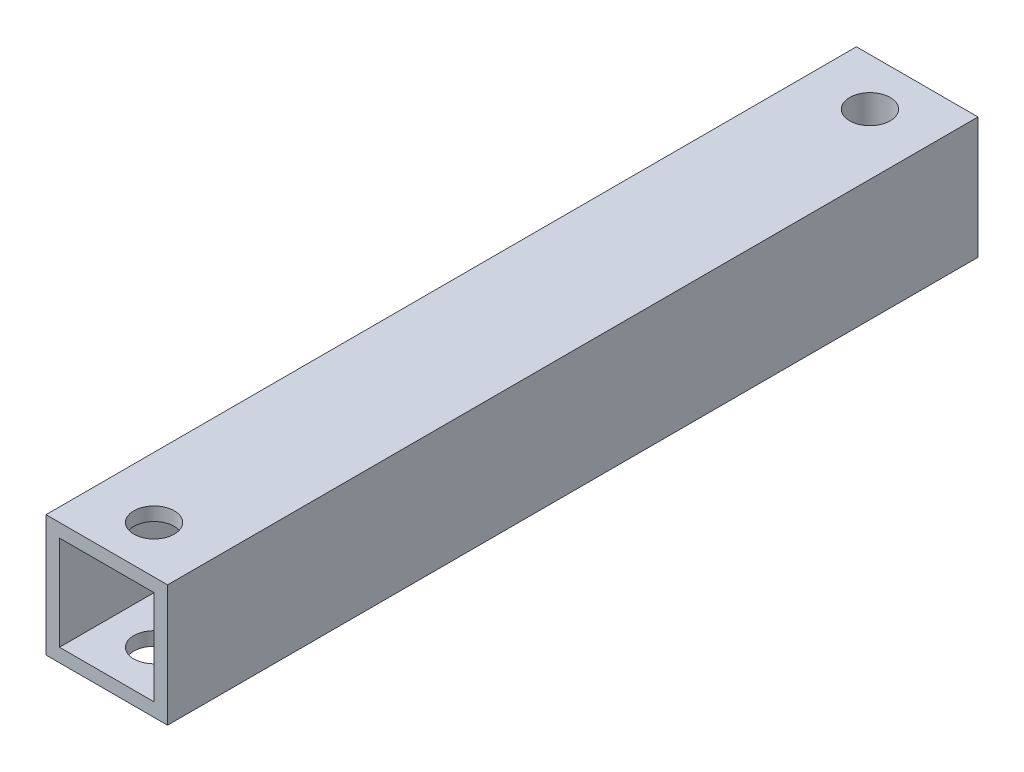
ISO-10303-21;
HEADER;
FILE_DESCRIPTION(('STEP AP214'),'2;1');
FILE_NAME('part.step','',(''),(''),'','','');
FILE_SCHEMA(('AUTOMOTIVE_DESIGN { 1 0 10303 214 1 1 1 1 }'));
ENDSEC;
DATA;
#1=APPLICATION_CONTEXT('core data for automotive mechanical design processes');
#2=APPLICATION_PROTOCOL_DEFINITION('international standard','automotive_design',2000,#1);
#3=PRODUCT_CONTEXT('',#1,'mechanical');
#4=PRODUCT('Part','Part','',(#3));
#5=PRODUCT_RELATED_PRODUCT_CATEGORY('part','',(#4));
#6=PRODUCT_DEFINITION_FORMATION('','',#4);
#7=PRODUCT_DEFINITION_CONTEXT('part definition',#1,'design');
#8=PRODUCT_DEFINITION('design','',#6,#7);
#9=PRODUCT_DEFINITION_SHAPE('','',#8);
#10=(LENGTH_UNIT() NAMED_UNIT(*) SI_UNIT(.MILLI.,.METRE.));
#11=(NAMED_UNIT(*) PLANE_ANGLE_UNIT() SI_UNIT($,.RADIAN.));
#12=(NAMED_UNIT(*) SI_UNIT($,.STERADIAN.) SOLID_ANGLE_UNIT());
#13=UNCERTAINTY_MEASURE_WITH_UNIT(LENGTH_MEASURE(1.E-05),#10,'distance_accuracy_value','');
#14=(GEOMETRIC_REPRESENTATION_CONTEXT(3) GLOBAL_UNCERTAINTY_ASSIGNED_CONTEXT((#13)) GLOBAL_UNIT_ASSIGNED_CONTEXT((#10,
#11,#12)) REPRESENTATION_CONTEXT('',''));
#15=CARTESIAN_POINT('',(0.,0.,0.));
#16=DIRECTION('',(0.,0.,1.));
#17=DIRECTION('',(1.,0.,0.));
#18=AXIS2_PLACEMENT_3D('',#15,#16,#17);
#19=CARTESIAN_POINT('',(0.,0.,4.));
#20=DIRECTION('',(0.,0.,1.));
#21=DIRECTION('',(1.,0.,0.));
#22=AXIS2_PLACEMENT_3D('',#19,#20,#21);
#23=PLANE('',#22);
#24=DIRECTION('',(0.,1.,0.));
#25=VECTOR('',#24,1.);
#26=CARTESIAN_POINT('',(1.4142135623731,-51.5,4.));
#27=LINE('',#26,#25);
#28=CARTESIAN_POINT('',(1.4142135623731,-3.5,4.));
#29=VERTEX_POINT('',#28);
#30=CARTESIAN_POINT('',(1.4142135623731,3.5,4.));
#31=VERTEX_POINT('',#30);
#32=EDGE_CURVE('E11',#29,#31,#27,.T.);
#33=ORIENTED_EDGE('',*,*,#32,.F.);
#34=DIRECTION('',(1.,0.,0.));
#35=VECTOR('',#34,1.);
#36=CARTESIAN_POINT('',(-3.5,-3.5,4.));
#37=LINE('',#36,#35);
#38=CARTESIAN_POINT('',(3.5,-3.5,4.));
#39=VERTEX_POINT('',#38);
#40=EDGE_CURVE('E123',#29,#39,#37,.T.);
#41=ORIENTED_EDGE('',*,*,#40,.T.);
#42=DIRECTION('',(0.,1.,0.));
#43=VECTOR('',#42,1.);
#44=CARTESIAN_POINT('',(3.5,3.5,4.));
#45=LINE('',#44,#43);
#46=CARTESIAN_POINT('',(3.5,3.5,4.));
#47=VERTEX_POINT('',#46);
#48=EDGE_CURVE('E148',#39,#47,#45,.T.);
#49=ORIENTED_EDGE('',*,*,#48,.T.);
#50=DIRECTION('',(-1.,0.,0.));
#51=VECTOR('',#50,1.);
#52=CARTESIAN_POINT('',(-3.5,3.5,4.));
#53=LINE('',#52,#51);
#54=EDGE_CURVE('E260',#47,#31,#53,.T.);
#55=ORIENTED_EDGE('',*,*,#54,.T.);
#56=EDGE_LOOP('',(#33,#41,#49,#55));
#57=FACE_BOUND('',#56,.T.);
#58=ADVANCED_FACE('F33',(#57),#23,.T.);
#59=CARTESIAN_POINT('',(4.5,4.5,60.));
#60=DIRECTION('',(-1.,0.,0.));
#61=DIRECTION('',(0.,0.,1.));
#62=AXIS2_PLACEMENT_3D('',#59,#60,#61);
#63=PLANE('',#62);
#64=DIRECTION('',(0.,1.,0.));
#65=VECTOR('',#64,1.);
#66=CARTESIAN_POINT('',(4.5,4.5,0.));
#67=LINE('',#66,#65);
#68=CARTESIAN_POINT('',(4.5,-4.5,0.));
#69=VERTEX_POINT('',#68);
#70=CARTESIAN_POINT('',(4.5,4.5,0.));
#71=VERTEX_POINT('',#70);
#72=EDGE_CURVE('E151',#69,#71,#67,.T.);
#73=ORIENTED_EDGE('',*,*,#72,.T.);
#74=DIRECTION('',(0.,0.,-1.));
#75=VECTOR('',#74,1.);
#76=CARTESIAN_POINT('',(4.5,4.5,60.));
#77=LINE('',#76,#75);
#78=CARTESIAN_POINT('',(4.5,4.5,60.));
#79=VERTEX_POINT('',#78);
#80=EDGE_CURVE('E115',#79,#71,#77,.T.);
#81=ORIENTED_EDGE('',*,*,#80,.F.);
#82=DIRECTION('',(0.,1.,0.));
#83=VECTOR('',#82,1.);
#84=CARTESIAN_POINT('',(4.5,4.5,60.));
#85=LINE('',#84,#83);
#86=CARTESIAN_POINT('',(4.5,-4.5,60.));
#87=VERTEX_POINT('',#86);
#88=EDGE_CURVE('E155',#87,#79,#85,.T.);
#89=ORIENTED_EDGE('',*,*,#88,.F.);
#90=DIRECTION('',(0.,0.,-1.));
#91=VECTOR('',#90,1.);
#92=CARTESIAN_POINT('',(4.5,-4.5,60.));
#93=LINE('',#92,#91);
#94=EDGE_CURVE('E165',#87,#69,#93,.T.);
#95=ORIENTED_EDGE('',*,*,#94,.T.);
#96=EDGE_LOOP('',(#73,#81,#89,#95));
#97=FACE_BOUND('',#96,.T.);
#98=ADVANCED_FACE('F35',(#97),#63,.F.);
#99=CARTESIAN_POINT('',(-4.5,4.5,60.));
#100=DIRECTION('',(0.,-1.,0.));
#101=DIRECTION('',(0.,0.,-1.));
#102=AXIS2_PLACEMENT_3D('',#99,#100,#101);
#103=PLANE('',#102);
#104=CARTESIAN_POINT('',(0.,4.5,3.5));
#105=DIRECTION('',(0.,1.,0.));
#106=DIRECTION('',(0.,0.,1.));
#107=AXIS2_PLACEMENT_3D('',#104,#105,#106);
#108=CIRCLE('',#107,1.5);
#109=CARTESIAN_POINT('',(0.,4.5,5.));
#110=VERTEX_POINT('',#109);
#111=EDGE_CURVE('E268',#110,#110,#108,.T.);
#112=ORIENTED_EDGE('',*,*,#111,.F.);
#113=EDGE_LOOP('',(#112));
#114=FACE_BOUND('',#113,.T.);
#115=CARTESIAN_POINT('',(0.,4.5,56.5));
#116=DIRECTION('',(0.,1.,0.));
#117=DIRECTION('',(0.,0.,1.));
#118=AXIS2_PLACEMENT_3D('',#115,#116,#117);
#119=CIRCLE('',#118,1.5);
#120=CARTESIAN_POINT('',(0.,4.5,58.));
#121=VERTEX_POINT('',#120);
#122=EDGE_CURVE('E271',#121,#121,#119,.T.);
#123=ORIENTED_EDGE('',*,*,#122,.F.);
#124=EDGE_LOOP('',(#123));
#125=FACE_BOUND('',#124,.T.);
#126=DIRECTION('',(-1.,0.,0.));
#127=VECTOR('',#126,1.);
#128=CARTESIAN_POINT('',(-4.5,4.5,0.));
#129=LINE('',#128,#127);
#130=CARTESIAN_POINT('',(-4.5,4.5,0.));
#131=VERTEX_POINT('',#130);
#132=EDGE_CURVE('E168',#71,#131,#129,.T.);
#133=ORIENTED_EDGE('',*,*,#132,.T.);
#134=DIRECTION('',(0.,0.,-1.));
#135=VECTOR('',#134,1.);
#136=CARTESIAN_POINT('',(-4.5,4.5,60.));
#137=LINE('',#136,#135);
#138=CARTESIAN_POINT('',(-4.5,4.5,60.));
#139=VERTEX_POINT('',#138);
#140=EDGE_CURVE('E178',#139,#131,#137,.T.);
#141=ORIENTED_EDGE('',*,*,#140,.F.);
#142=DIRECTION('',(-1.,0.,0.));
#143=VECTOR('',#142,1.);
#144=CARTESIAN_POINT('',(-4.5,4.5,60.));
#145=LINE('',#144,#143);
#146=EDGE_CURVE('E158',#79,#139,#145,.T.);
#147=ORIENTED_EDGE('',*,*,#146,.F.);
#148=ORIENTED_EDGE('',*,*,#80,.T.);
#149=EDGE_LOOP('',(#133,#141,#147,#148));
#150=FACE_BOUND('',#149,.T.);
#151=ADVANCED_FACE('F184',(#114,#125,#150),#103,.F.);
#152=CARTESIAN_POINT('',(-4.5,4.5,60.));
#153=DIRECTION('',(1.,0.,0.));
#154=DIRECTION('',(0.,1.,0.));
#155=AXIS2_PLACEMENT_3D('',#152,#153,#154);
#156=PLANE('',#155);
#157=DIRECTION('',(0.,-1.,0.));
#158=VECTOR('',#157,1.);
#159=CARTESIAN_POINT('',(-4.5,4.5,0.));
#160=LINE('',#159,#158);
#161=CARTESIAN_POINT('',(-4.5,-4.5,0.));
#162=VERTEX_POINT('',#161);
#163=EDGE_CURVE('E170',#131,#162,#160,.T.);
#164=ORIENTED_EDGE('',*,*,#163,.T.);
#165=DIRECTION('',(0.,0.,-1.));
#166=VECTOR('',#165,1.);
#167=CARTESIAN_POINT('',(-4.5,-4.5,60.));
#168=LINE('',#167,#166);
#169=CARTESIAN_POINT('',(-4.5,-4.5,60.));
#170=VERTEX_POINT('',#169);
#171=EDGE_CURVE('E175',#170,#162,#168,.T.);
#172=ORIENTED_EDGE('',*,*,#171,.F.);
#173=DIRECTION('',(0.,-1.,0.));
#174=VECTOR('',#173,1.);
#175=CARTESIAN_POINT('',(-4.5,4.5,60.));
#176=LINE('',#175,#174);
#177=EDGE_CURVE('E161',#139,#170,#176,.T.);
#178=ORIENTED_EDGE('',*,*,#177,.F.);
#179=ORIENTED_EDGE('',*,*,#140,.T.);
#180=EDGE_LOOP('',(#164,#172,#178,#179));
#181=FACE_BOUND('',#180,.T.);
#182=ADVANCED_FACE('F196',(#181),#156,.F.);
#183=CARTESIAN_POINT('',(-4.5,-4.5,60.));
#184=DIRECTION('',(0.,1.,0.));
#185=DIRECTION('',(0.,0.,1.));
#186=AXIS2_PLACEMENT_3D('',#183,#184,#185);
#187=PLANE('',#186);
#188=CARTESIAN_POINT('',(0.,-4.5,3.5));
#189=DIRECTION('',(0.,1.,0.));
#190=DIRECTION('',(0.,0.,1.));
#191=AXIS2_PLACEMENT_3D('',#188,#189,#190);
#192=CIRCLE('',#191,1.5);
#193=CARTESIAN_POINT('',(0.,-4.5,5.));
#194=VERTEX_POINT('',#193);
#195=EDGE_CURVE('E124',#194,#194,#192,.T.);
#196=ORIENTED_EDGE('',*,*,#195,.T.);
#197=EDGE_LOOP('',(#196));
#198=FACE_BOUND('',#197,.T.);
#199=CARTESIAN_POINT('',(0.,-4.5,56.5));
#200=DIRECTION('',(0.,1.,0.));
#201=DIRECTION('',(0.,0.,1.));
#202=AXIS2_PLACEMENT_3D('',#199,#200,#201);
#203=CIRCLE('',#202,1.5);
#204=CARTESIAN_POINT('',(0.,-4.5,58.));
#205=VERTEX_POINT('',#204);
#206=EDGE_CURVE('E139',#205,#205,#203,.T.);
#207=ORIENTED_EDGE('',*,*,#206,.T.);
#208=EDGE_LOOP('',(#207));
#209=FACE_BOUND('',#208,.T.);
#210=DIRECTION('',(1.,0.,0.));
#211=VECTOR('',#210,1.);
#212=CARTESIAN_POINT('',(-4.5,-4.5,0.));
#213=LINE('',#212,#211);
#214=EDGE_CURVE('E159',#162,#69,#213,.T.);
#215=ORIENTED_EDGE('',*,*,#214,.T.);
#216=ORIENTED_EDGE('',*,*,#94,.F.);
#217=DIRECTION('',(1.,0.,0.));
#218=VECTOR('',#217,1.);
#219=CARTESIAN_POINT('',(-4.5,-4.5,60.));
#220=LINE('',#219,#218);
#221=EDGE_CURVE('E163',#170,#87,#220,.T.);
#222=ORIENTED_EDGE('',*,*,#221,.F.);
#223=ORIENTED_EDGE('',*,*,#171,.T.);
#224=EDGE_LOOP('',(#215,#216,#222,#223));
#225=FACE_BOUND('',#224,.T.);
#226=ADVANCED_FACE('F200',(#198,#209,#225),#187,.F.);
#227=CARTESIAN_POINT('',(0.,0.,60.));
#228=DIRECTION('',(0.,0.,1.));
#229=DIRECTION('',(1.,0.,0.));
#230=AXIS2_PLACEMENT_3D('',#227,#228,#229);
#231=PLANE('',#230);
#232=DIRECTION('',(0.,1.,0.));
#233=VECTOR('',#232,1.);
#234=CARTESIAN_POINT('',(3.5,3.5,60.));
#235=LINE('',#234,#233);
#236=CARTESIAN_POINT('',(3.5,-3.5,60.));
#237=VERTEX_POINT('',#236);
#238=CARTESIAN_POINT('',(3.5,3.5,60.));
#239=VERTEX_POINT('',#238);
#240=EDGE_CURVE('E56',#237,#239,#235,.T.);
#241=ORIENTED_EDGE('',*,*,#240,.F.);
#242=DIRECTION('',(1.,0.,0.));
#243=VECTOR('',#242,1.);
#244=CARTESIAN_POINT('',(-3.5,-3.5,60.));
#245=LINE('',#244,#243);
#246=CARTESIAN_POINT('',(-3.5,-3.5,60.));
#247=VERTEX_POINT('',#246);
#248=EDGE_CURVE('E145',#247,#237,#245,.T.);
#249=ORIENTED_EDGE('',*,*,#248,.F.);
#250=DIRECTION('',(0.,-1.,0.));
#251=VECTOR('',#250,1.);
#252=CARTESIAN_POINT('',(-3.5,3.5,60.));
#253=LINE('',#252,#251);
#254=CARTESIAN_POINT('',(-3.5,3.5,60.));
#255=VERTEX_POINT('',#254);
#256=EDGE_CURVE('E142',#255,#247,#253,.T.);
#257=ORIENTED_EDGE('',*,*,#256,.F.);
#258=DIRECTION('',(-1.,0.,0.));
#259=VECTOR('',#258,1.);
#260=CARTESIAN_POINT('',(-3.5,3.5,60.));
#261=LINE('',#260,#259);
#262=EDGE_CURVE('E138',#239,#255,#261,.T.);
#263=ORIENTED_EDGE('',*,*,#262,.F.);
#264=EDGE_LOOP('',(#241,#249,#257,#263));
#265=FACE_BOUND('',#264,.T.);
#266=ORIENTED_EDGE('',*,*,#88,.T.);
#267=ORIENTED_EDGE('',*,*,#146,.T.);
#268=ORIENTED_EDGE('',*,*,#177,.T.);
#269=ORIENTED_EDGE('',*,*,#221,.T.);
#270=EDGE_LOOP('',(#266,#267,#268,#269));
#271=FACE_BOUND('',#270,.T.);
#272=ADVANCED_FACE('F202',(#265,#271),#231,.T.);
#273=CARTESIAN_POINT('',(0.,0.,0.));
#274=DIRECTION('',(0.,0.,1.));
#275=DIRECTION('',(1.,0.,0.));
#276=AXIS2_PLACEMENT_3D('',#273,#274,#275);
#277=PLANE('',#276);
#278=ORIENTED_EDGE('',*,*,#72,.F.);
#279=ORIENTED_EDGE('',*,*,#214,.F.);
#280=ORIENTED_EDGE('',*,*,#163,.F.);
#281=ORIENTED_EDGE('',*,*,#132,.F.);
#282=EDGE_LOOP('',(#278,#279,#280,#281));
#283=FACE_BOUND('',#282,.T.);
#284=ADVANCED_FACE('F192',(#283),#277,.F.);
#285=CARTESIAN_POINT('',(3.5,3.5,4.));
#286=DIRECTION('',(1.,0.,0.));
#287=DIRECTION('',(0.,1.,0.));
#288=AXIS2_PLACEMENT_3D('',#285,#286,#287);
#289=PLANE('',#288);
#290=ORIENTED_EDGE('',*,*,#240,.T.);
#291=DIRECTION('',(0.,0.,1.));
#292=VECTOR('',#291,1.);
#293=CARTESIAN_POINT('',(3.5,3.5,4.));
#294=LINE('',#293,#292);
#295=EDGE_CURVE('E130',#47,#239,#294,.T.);
#296=ORIENTED_EDGE('',*,*,#295,.F.);
#297=ORIENTED_EDGE('',*,*,#48,.F.);
#298=DIRECTION('',(0.,0.,1.));
#299=VECTOR('',#298,1.);
#300=CARTESIAN_POINT('',(3.5,-3.5,4.));
#301=LINE('',#300,#299);
#302=EDGE_CURVE('E149',#39,#237,#301,.T.);
#303=ORIENTED_EDGE('',*,*,#302,.T.);
#304=EDGE_LOOP('',(#290,#296,#297,#303));
#305=FACE_BOUND('',#304,.T.);
#306=ADVANCED_FACE('F210',(#305),#289,.F.);
#307=CARTESIAN_POINT('',(-3.5,-3.5,4.));
#308=DIRECTION('',(0.,-1.,0.));
#309=DIRECTION('',(0.,0.,-1.));
#310=AXIS2_PLACEMENT_3D('',#307,#308,#309);
#311=PLANE('',#310);
#312=CARTESIAN_POINT('',(0.,-3.5,56.5));
#313=DIRECTION('',(0.,-1.,0.));
#314=DIRECTION('',(0.,0.,-1.));
#315=AXIS2_PLACEMENT_3D('',#312,#313,#314);
#316=CIRCLE('',#315,1.5);
#317=CARTESIAN_POINT('',(0.,-3.5,55.));
#318=VERTEX_POINT('',#317);
#319=EDGE_CURVE('E251',#318,#318,#316,.T.);
#320=ORIENTED_EDGE('',*,*,#319,.T.);
#321=EDGE_LOOP('',(#320));
#322=FACE_BOUND('',#321,.T.);
#323=ORIENTED_EDGE('',*,*,#40,.F.);
#324=CARTESIAN_POINT('',(0.,-3.5,3.5));
#325=DIRECTION('',(0.,-1.,0.));
#326=DIRECTION('',(0.,0.,-1.));
#327=AXIS2_PLACEMENT_3D('',#324,#325,#326);
#328=CIRCLE('',#327,1.5);
#329=CARTESIAN_POINT('',(-1.4142135623731,-3.5,4.));
#330=VERTEX_POINT('',#329);
#331=EDGE_CURVE('E110',#29,#330,#328,.T.);
#332=ORIENTED_EDGE('',*,*,#331,.T.);
#333=CARTESIAN_POINT('',(-3.5,-3.5,4.));
#334=VERTEX_POINT('',#333);
#335=EDGE_CURVE('E121',#334,#330,#37,.T.);
#336=ORIENTED_EDGE('',*,*,#335,.F.);
#337=DIRECTION('',(0.,0.,1.));
#338=VECTOR('',#337,1.);
#339=CARTESIAN_POINT('',(-3.5,-3.5,4.));
#340=LINE('',#339,#338);
#341=EDGE_CURVE('E152',#334,#247,#340,.T.);
#342=ORIENTED_EDGE('',*,*,#341,.T.);
#343=ORIENTED_EDGE('',*,*,#248,.T.);
#344=ORIENTED_EDGE('',*,*,#302,.F.);
#345=EDGE_LOOP('',(#323,#332,#336,#342,#343,#344));
#346=FACE_BOUND('',#345,.T.);
#347=ADVANCED_FACE('F120',(#322,#346),#311,.F.);
#348=CARTESIAN_POINT('',(-3.5,3.5,4.));
#349=DIRECTION('',(-1.,0.,0.));
#350=DIRECTION('',(0.,-1.,0.));
#351=AXIS2_PLACEMENT_3D('',#348,#349,#350);
#352=PLANE('',#351);
#353=ORIENTED_EDGE('',*,*,#256,.T.);
#354=ORIENTED_EDGE('',*,*,#341,.F.);
#355=DIRECTION('',(0.,-1.,0.));
#356=VECTOR('',#355,1.);
#357=CARTESIAN_POINT('',(-3.5,3.5,4.));
#358=LINE('',#357,#356);
#359=CARTESIAN_POINT('',(-3.5,3.5,4.));
#360=VERTEX_POINT('',#359);
#361=EDGE_CURVE('E129',#360,#334,#358,.T.);
#362=ORIENTED_EDGE('',*,*,#361,.F.);
#363=DIRECTION('',(0.,0.,1.));
#364=VECTOR('',#363,1.);
#365=CARTESIAN_POINT('',(-3.5,3.5,4.));
#366=LINE('',#365,#364);
#367=EDGE_CURVE('E132',#360,#255,#366,.T.);
#368=ORIENTED_EDGE('',*,*,#367,.T.);
#369=EDGE_LOOP('',(#353,#354,#362,#368));
#370=FACE_BOUND('',#369,.T.);
#371=ADVANCED_FACE('F232',(#370),#352,.F.);
#372=CARTESIAN_POINT('',(-3.5,3.5,4.));
#373=DIRECTION('',(0.,1.,0.));
#374=DIRECTION('',(0.,0.,1.));
#375=AXIS2_PLACEMENT_3D('',#372,#373,#374);
#376=PLANE('',#375);
#377=CARTESIAN_POINT('',(0.,3.5,56.5));
#378=DIRECTION('',(0.,1.,0.));
#379=DIRECTION('',(0.,0.,1.));
#380=AXIS2_PLACEMENT_3D('',#377,#378,#379);
#381=CIRCLE('',#380,1.5);
#382=CARTESIAN_POINT('',(0.,3.5,58.));
#383=VERTEX_POINT('',#382);
#384=EDGE_CURVE('E37',#383,#383,#381,.T.);
#385=ORIENTED_EDGE('',*,*,#384,.T.);
#386=EDGE_LOOP('',(#385));
#387=FACE_BOUND('',#386,.T.);
#388=CARTESIAN_POINT('',(-1.4142135623731,3.5,4.));
#389=VERTEX_POINT('',#388);
#390=EDGE_CURVE('E259',#389,#360,#53,.T.);
#391=ORIENTED_EDGE('',*,*,#390,.F.);
#392=CARTESIAN_POINT('',(0.,3.5,3.5));
#393=DIRECTION('',(0.,1.,0.));
#394=DIRECTION('',(0.,0.,1.));
#395=AXIS2_PLACEMENT_3D('',#392,#393,#394);
#396=CIRCLE('',#395,1.5);
#397=EDGE_CURVE('E48',#389,#31,#396,.T.);
#398=ORIENTED_EDGE('',*,*,#397,.T.);
#399=ORIENTED_EDGE('',*,*,#54,.F.);
#400=ORIENTED_EDGE('',*,*,#295,.T.);
#401=ORIENTED_EDGE('',*,*,#262,.T.);
#402=ORIENTED_EDGE('',*,*,#367,.F.);
#403=EDGE_LOOP('',(#391,#398,#399,#400,#401,#402));
#404=FACE_BOUND('',#403,.T.);
#405=ADVANCED_FACE('F224',(#387,#404),#376,.F.);
#406=DIRECTION('',(0.,1.,0.));
#407=VECTOR('',#406,1.);
#408=CARTESIAN_POINT('',(-1.4142135623731,-51.5,4.));
#409=LINE('',#408,#407);
#410=EDGE_CURVE('E42',#389,#330,#409,.F.);
#411=ORIENTED_EDGE('',*,*,#410,.F.);
#412=ORIENTED_EDGE('',*,*,#390,.T.);
#413=ORIENTED_EDGE('',*,*,#361,.T.);
#414=ORIENTED_EDGE('',*,*,#335,.T.);
#415=EDGE_LOOP('',(#411,#412,#413,#414));
#416=FACE_BOUND('',#415,.T.);
#417=ADVANCED_FACE('F127',(#416),#23,.T.);
#418=CARTESIAN_POINT('',(0.,-51.5,3.5));
#419=DIRECTION('',(0.,1.,0.));
#420=DIRECTION('',(0.,0.,1.));
#421=AXIS2_PLACEMENT_3D('',#418,#419,#420);
#422=CYLINDRICAL_SURFACE('',#421,1.5);
#423=ORIENTED_EDGE('',*,*,#111,.T.);
#424=EDGE_LOOP('',(#423));
#425=FACE_BOUND('',#424,.T.);
#426=ORIENTED_EDGE('',*,*,#32,.T.);
#427=ORIENTED_EDGE('',*,*,#397,.F.);
#428=ORIENTED_EDGE('',*,*,#410,.T.);
#429=ORIENTED_EDGE('',*,*,#331,.F.);
#430=EDGE_LOOP('',(#426,#427,#428,#429));
#431=FACE_BOUND('',#430,.T.);
#432=ORIENTED_EDGE('',*,*,#195,.F.);
#433=EDGE_LOOP('',(#432));
#434=FACE_BOUND('',#433,.T.);
#435=ADVANCED_FACE('F108',(#425,#431,#434),#422,.F.);
#436=CARTESIAN_POINT('',(0.,-51.5,56.5));
#437=DIRECTION('',(0.,1.,0.));
#438=DIRECTION('',(0.,0.,1.));
#439=AXIS2_PLACEMENT_3D('',#436,#437,#438);
#440=CYLINDRICAL_SURFACE('',#439,1.5);
#441=ORIENTED_EDGE('',*,*,#122,.T.);
#442=EDGE_LOOP('',(#441));
#443=FACE_BOUND('',#442,.T.);
#444=ORIENTED_EDGE('',*,*,#384,.F.);
#445=EDGE_LOOP('',(#444));
#446=FACE_BOUND('',#445,.T.);
#447=ADVANCED_FACE('F229',(#443,#446),#440,.F.);
#448=ORIENTED_EDGE('',*,*,#319,.F.);
#449=EDGE_LOOP('',(#448));
#450=FACE_BOUND('',#449,.T.);
#451=ORIENTED_EDGE('',*,*,#206,.F.);
#452=EDGE_LOOP('',(#451));
#453=FACE_BOUND('',#452,.T.);
#454=ADVANCED_FACE('F327',(#450,#453),#440,.F.);
#455=CLOSED_SHELL('',(#58,#98,#151,#182,#226,#272,#284,#306,#347,#371,#405,#417,#435,#447,#454));
#456=MANIFOLD_SOLID_BREP('B2',#455);
#457=ADVANCED_BREP_SHAPE_REPRESENTATION('',(#18,#456),#14);
#458=SHAPE_DEFINITION_REPRESENTATION(#9,#457);
ENDSEC;
END-ISO-10303-21;
